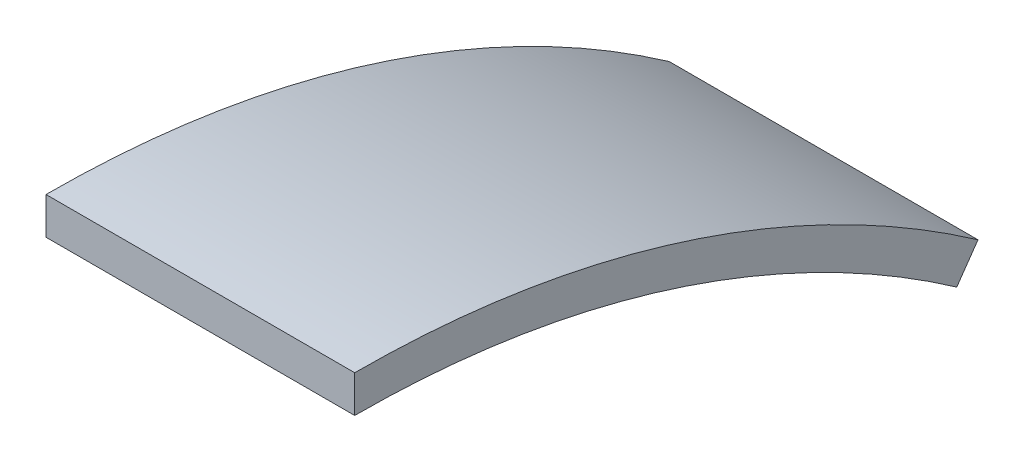
ISO-10303-21;
HEADER;
FILE_DESCRIPTION(('STEP AP214'),'2;1');
FILE_NAME('part.step','',(''),(''),'','','');
FILE_SCHEMA(('AUTOMOTIVE_DESIGN { 1 0 10303 214 1 1 1 1 }'));
ENDSEC;
DATA;
#1=APPLICATION_CONTEXT('core data for automotive mechanical design processes');
#2=APPLICATION_PROTOCOL_DEFINITION('international standard','automotive_design',2000,#1);
#3=PRODUCT_CONTEXT('',#1,'mechanical');
#4=PRODUCT('Part','Part','',(#3));
#5=PRODUCT_RELATED_PRODUCT_CATEGORY('part','',(#4));
#6=PRODUCT_DEFINITION_FORMATION('','',#4);
#7=PRODUCT_DEFINITION_CONTEXT('part definition',#1,'design');
#8=PRODUCT_DEFINITION('design','',#6,#7);
#9=PRODUCT_DEFINITION_SHAPE('','',#8);
#10=(LENGTH_UNIT() NAMED_UNIT(*) SI_UNIT(.MILLI.,.METRE.));
#11=(NAMED_UNIT(*) PLANE_ANGLE_UNIT() SI_UNIT($,.RADIAN.));
#12=(NAMED_UNIT(*) SI_UNIT($,.STERADIAN.) SOLID_ANGLE_UNIT());
#13=UNCERTAINTY_MEASURE_WITH_UNIT(LENGTH_MEASURE(1.E-05),#10,'distance_accuracy_value','');
#14=(GEOMETRIC_REPRESENTATION_CONTEXT(3) GLOBAL_UNCERTAINTY_ASSIGNED_CONTEXT((#13)) GLOBAL_UNIT_ASSIGNED_CONTEXT((#10,
#11,#12)) REPRESENTATION_CONTEXT('',''));
#15=CARTESIAN_POINT('',(0.,0.,0.));
#16=DIRECTION('',(0.,0.,1.));
#17=DIRECTION('',(1.,0.,0.));
#18=AXIS2_PLACEMENT_3D('',#15,#16,#17);
#19=CARTESIAN_POINT('',(25.,-1.03479636978148E-13,-1.47784237288742E-13));
#20=DIRECTION('',(0.,0.57357643635104,0.819152044288996));
#21=DIRECTION('',(0.,-0.819152044288996,0.57357643635104));
#22=AXIS2_PLACEMENT_3D('',#19,#20,#21);
#23=PLANE('',#22);
#24=DIRECTION('',(0.,0.819152044288996,-0.57357643635104));
#25=VECTOR('',#24,1.);
#26=CARTESIAN_POINT('',(0.,-1.03479636978148E-13,-1.47784237288742E-13));
#27=LINE('',#26,#25);
#28=CARTESIAN_POINT('',(0.,69.6279237645646,-48.7539970898385));
#29=VERTEX_POINT('',#28);
#30=CARTESIAN_POINT('',(0.,72.0853798974316,-50.4747263988916));
#31=VERTEX_POINT('',#30);
#32=EDGE_CURVE('E98',#29,#31,#27,.T.);
#33=ORIENTED_EDGE('',*,*,#32,.T.);
#34=DIRECTION('',(-1.,0.,0.));
#35=VECTOR('',#34,1.);
#36=CARTESIAN_POINT('',(25.,72.0853798974316,-50.4747263988916));
#37=LINE('',#36,#35);
#38=CARTESIAN_POINT('',(25.,72.0853798974316,-50.4747263988916));
#39=VERTEX_POINT('',#38);
#40=EDGE_CURVE('E11',#39,#31,#37,.T.);
#41=ORIENTED_EDGE('',*,*,#40,.F.);
#42=DIRECTION('',(0.,0.819152044288996,-0.57357643635104));
#43=VECTOR('',#42,1.);
#44=CARTESIAN_POINT('',(25.,-1.03479636978148E-13,-1.47784237288742E-13));
#45=LINE('',#44,#43);
#46=CARTESIAN_POINT('',(25.,69.6279237645646,-48.7539970898385));
#47=VERTEX_POINT('',#46);
#48=EDGE_CURVE('E84',#47,#39,#45,.T.);
#49=ORIENTED_EDGE('',*,*,#48,.F.);
#50=DIRECTION('',(-1.,0.,0.));
#51=VECTOR('',#50,1.);
#52=CARTESIAN_POINT('',(25.,69.6279237645646,-48.7539970898385));
#53=LINE('',#52,#51);
#54=EDGE_CURVE('E51',#47,#29,#53,.T.);
#55=ORIENTED_EDGE('',*,*,#54,.T.);
#56=EDGE_LOOP('',(#33,#41,#49,#55));
#57=FACE_BOUND('',#56,.T.);
#58=ADVANCED_FACE('F35',(#57),#23,.F.);
#59=CARTESIAN_POINT('',(25.,0.,0.));
#60=DIRECTION('',(-1.,0.,0.));
#61=DIRECTION('',(0.,0.,1.));
#62=AXIS2_PLACEMENT_3D('',#59,#60,#61);
#63=CYLINDRICAL_SURFACE('',#62,88.);
#64=CARTESIAN_POINT('',(0.,0.,0.));
#65=DIRECTION('',(1.,0.,0.));
#66=DIRECTION('',(0.,0.,-1.));
#67=AXIS2_PLACEMENT_3D('',#64,#65,#66);
#68=CIRCLE('',#67,88.);
#69=CARTESIAN_POINT('',(0.,88.,0.));
#70=VERTEX_POINT('',#69);
#71=EDGE_CURVE('E89',#31,#70,#68,.T.);
#72=ORIENTED_EDGE('',*,*,#71,.T.);
#73=DIRECTION('',(-1.,0.,0.));
#74=VECTOR('',#73,1.);
#75=CARTESIAN_POINT('',(25.,88.,0.));
#76=LINE('',#75,#74);
#77=CARTESIAN_POINT('',(25.,88.,0.));
#78=VERTEX_POINT('',#77);
#79=EDGE_CURVE('E43',#78,#70,#76,.T.);
#80=ORIENTED_EDGE('',*,*,#79,.F.);
#81=CARTESIAN_POINT('',(25.,0.,0.));
#82=DIRECTION('',(1.,0.,0.));
#83=DIRECTION('',(0.,0.,-1.));
#84=AXIS2_PLACEMENT_3D('',#81,#82,#83);
#85=CIRCLE('',#84,88.);
#86=EDGE_CURVE('E76',#39,#78,#85,.T.);
#87=ORIENTED_EDGE('',*,*,#86,.F.);
#88=ORIENTED_EDGE('',*,*,#40,.T.);
#89=EDGE_LOOP('',(#72,#80,#87,#88));
#90=FACE_BOUND('',#89,.T.);
#91=ADVANCED_FACE('F88',(#90),#63,.T.);
#92=CARTESIAN_POINT('',(25.,0.,0.));
#93=DIRECTION('',(0.,0.,1.));
#94=DIRECTION('',(1.,0.,0.));
#95=AXIS2_PLACEMENT_3D('',#92,#93,#94);
#96=PLANE('',#95);
#97=DIRECTION('',(0.,1.,0.));
#98=VECTOR('',#97,1.);
#99=CARTESIAN_POINT('',(0.,0.,0.));
#100=LINE('',#99,#98);
#101=CARTESIAN_POINT('',(0.,85.,0.));
#102=VERTEX_POINT('',#101);
#103=EDGE_CURVE('E101',#102,#70,#100,.T.);
#104=ORIENTED_EDGE('',*,*,#103,.F.);
#105=DIRECTION('',(-1.,0.,0.));
#106=VECTOR('',#105,1.);
#107=CARTESIAN_POINT('',(25.,85.,0.));
#108=LINE('',#107,#106);
#109=CARTESIAN_POINT('',(25.,85.,0.));
#110=VERTEX_POINT('',#109);
#111=EDGE_CURVE('E65',#110,#102,#108,.T.);
#112=ORIENTED_EDGE('',*,*,#111,.F.);
#113=DIRECTION('',(0.,1.,0.));
#114=VECTOR('',#113,1.);
#115=CARTESIAN_POINT('',(25.,0.,0.));
#116=LINE('',#115,#114);
#117=EDGE_CURVE('E83',#110,#78,#116,.T.);
#118=ORIENTED_EDGE('',*,*,#117,.T.);
#119=ORIENTED_EDGE('',*,*,#79,.T.);
#120=EDGE_LOOP('',(#104,#112,#118,#119));
#121=FACE_BOUND('',#120,.T.);
#122=ADVANCED_FACE('F92',(#121),#96,.T.);
#123=CARTESIAN_POINT('',(25.,0.,0.));
#124=DIRECTION('',(-1.,0.,0.));
#125=DIRECTION('',(0.,0.,1.));
#126=AXIS2_PLACEMENT_3D('',#123,#124,#125);
#127=CYLINDRICAL_SURFACE('',#126,85.);
#128=CARTESIAN_POINT('',(0.,0.,0.));
#129=DIRECTION('',(1.,0.,0.));
#130=DIRECTION('',(0.,0.,-1.));
#131=AXIS2_PLACEMENT_3D('',#128,#129,#130);
#132=CIRCLE('',#131,85.);
#133=EDGE_CURVE('E103',#29,#102,#132,.T.);
#134=ORIENTED_EDGE('',*,*,#133,.F.);
#135=ORIENTED_EDGE('',*,*,#54,.F.);
#136=CARTESIAN_POINT('',(25.,0.,0.));
#137=DIRECTION('',(1.,0.,0.));
#138=DIRECTION('',(0.,0.,-1.));
#139=AXIS2_PLACEMENT_3D('',#136,#137,#138);
#140=CIRCLE('',#139,85.);
#141=EDGE_CURVE('E93',#47,#110,#140,.T.);
#142=ORIENTED_EDGE('',*,*,#141,.T.);
#143=ORIENTED_EDGE('',*,*,#111,.T.);
#144=EDGE_LOOP('',(#134,#135,#142,#143));
#145=FACE_BOUND('',#144,.T.);
#146=ADVANCED_FACE('F109',(#145),#127,.F.);
#147=CARTESIAN_POINT('',(25.,0.,0.));
#148=DIRECTION('',(1.,0.,0.));
#149=DIRECTION('',(0.,0.,-1.));
#150=AXIS2_PLACEMENT_3D('',#147,#148,#149);
#151=PLANE('',#150);
#152=ORIENTED_EDGE('',*,*,#48,.T.);
#153=ORIENTED_EDGE('',*,*,#86,.T.);
#154=ORIENTED_EDGE('',*,*,#117,.F.);
#155=ORIENTED_EDGE('',*,*,#141,.F.);
#156=EDGE_LOOP('',(#152,#153,#154,#155));
#157=FACE_BOUND('',#156,.T.);
#158=ADVANCED_FACE('F80',(#157),#151,.T.);
#159=CARTESIAN_POINT('',(0.,0.,0.));
#160=DIRECTION('',(1.,0.,0.));
#161=DIRECTION('',(0.,0.,-1.));
#162=AXIS2_PLACEMENT_3D('',#159,#160,#161);
#163=PLANE('',#162);
#164=ORIENTED_EDGE('',*,*,#32,.F.);
#165=ORIENTED_EDGE('',*,*,#133,.T.);
#166=ORIENTED_EDGE('',*,*,#103,.T.);
#167=ORIENTED_EDGE('',*,*,#71,.F.);
#168=EDGE_LOOP('',(#164,#165,#166,#167));
#169=FACE_BOUND('',#168,.T.);
#170=ADVANCED_FACE('F108',(#169),#163,.F.);
#171=CLOSED_SHELL('',(#58,#91,#122,#146,#158,#170));
#172=MANIFOLD_SOLID_BREP('B2',#171);
#173=ADVANCED_BREP_SHAPE_REPRESENTATION('',(#18,#172),#14);
#174=SHAPE_DEFINITION_REPRESENTATION(#9,#173);
ENDSEC;
END-ISO-10303-21;
